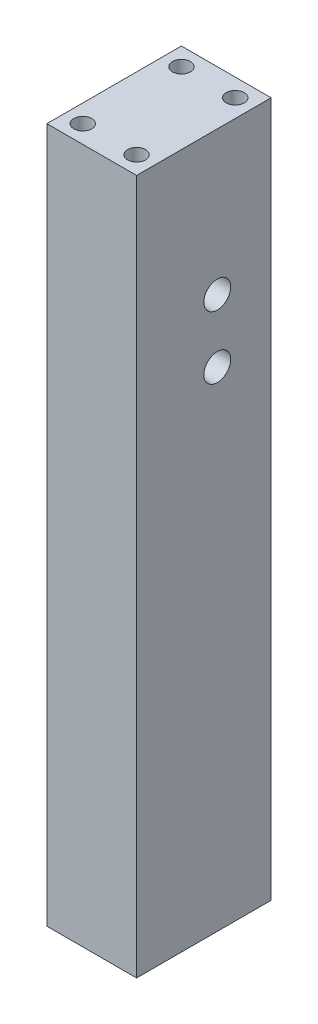
ISO-10303-21;
HEADER;
FILE_DESCRIPTION(('STEP AP214'),'2;1');
FILE_NAME('part.step','',(''),(''),'','','');
FILE_SCHEMA(('AUTOMOTIVE_DESIGN { 1 0 10303 214 1 1 1 1 }'));
ENDSEC;
DATA;
#1=APPLICATION_CONTEXT('core data for automotive mechanical design processes');
#2=APPLICATION_PROTOCOL_DEFINITION('international standard','automotive_design',2000,#1);
#3=PRODUCT_CONTEXT('',#1,'mechanical');
#4=PRODUCT('Part','Part','',(#3));
#5=PRODUCT_RELATED_PRODUCT_CATEGORY('part','',(#4));
#6=PRODUCT_DEFINITION_FORMATION('','',#4);
#7=PRODUCT_DEFINITION_CONTEXT('part definition',#1,'design');
#8=PRODUCT_DEFINITION('design','',#6,#7);
#9=PRODUCT_DEFINITION_SHAPE('','',#8);
#10=(LENGTH_UNIT() NAMED_UNIT(*) SI_UNIT(.MILLI.,.METRE.));
#11=(NAMED_UNIT(*) PLANE_ANGLE_UNIT() SI_UNIT($,.RADIAN.));
#12=(NAMED_UNIT(*) SI_UNIT($,.STERADIAN.) SOLID_ANGLE_UNIT());
#13=UNCERTAINTY_MEASURE_WITH_UNIT(LENGTH_MEASURE(1.E-05),#10,'distance_accuracy_value','');
#14=(GEOMETRIC_REPRESENTATION_CONTEXT(3) GLOBAL_UNCERTAINTY_ASSIGNED_CONTEXT((#13)) GLOBAL_UNIT_ASSIGNED_CONTEXT((#10,
#11,#12)) REPRESENTATION_CONTEXT('',''));
#15=CARTESIAN_POINT('',(0.,0.,0.));
#16=DIRECTION('',(0.,0.,1.));
#17=DIRECTION('',(1.,0.,0.));
#18=AXIS2_PLACEMENT_3D('',#15,#16,#17);
#19=CARTESIAN_POINT('',(10.,0.,0.));
#20=DIRECTION('',(-1.,0.,0.));
#21=DIRECTION('',(0.,0.,1.));
#22=AXIS2_PLACEMENT_3D('',#19,#20,#21);
#23=PLANE('',#22);
#24=DIRECTION('',(0.,-1.,0.));
#25=VECTOR('',#24,1.);
#26=CARTESIAN_POINT('',(10.,0.,0.));
#27=LINE('',#26,#25);
#28=CARTESIAN_POINT('',(10.,77.5,0.));
#29=VERTEX_POINT('',#28);
#30=CARTESIAN_POINT('',(10.,0.,0.));
#31=VERTEX_POINT('',#30);
#32=EDGE_CURVE('E84',#29,#31,#27,.T.);
#33=ORIENTED_EDGE('',*,*,#32,.T.);
#34=DIRECTION('',(0.,0.,-1.));
#35=VECTOR('',#34,1.);
#36=CARTESIAN_POINT('',(10.,0.,0.));
#37=LINE('',#36,#35);
#38=CARTESIAN_POINT('',(10.,0.,-15.));
#39=VERTEX_POINT('',#38);
#40=EDGE_CURVE('E79',#31,#39,#37,.T.);
#41=ORIENTED_EDGE('',*,*,#40,.T.);
#42=DIRECTION('',(0.,1.,0.));
#43=VECTOR('',#42,1.);
#44=CARTESIAN_POINT('',(10.,0.,-15.));
#45=LINE('',#44,#43);
#46=CARTESIAN_POINT('',(10.,77.5,-15.));
#47=VERTEX_POINT('',#46);
#48=EDGE_CURVE('E82',#39,#47,#45,.T.);
#49=ORIENTED_EDGE('',*,*,#48,.T.);
#50=DIRECTION('',(0.,0.,1.));
#51=VECTOR('',#50,1.);
#52=CARTESIAN_POINT('',(10.,77.5,0.));
#53=LINE('',#52,#51);
#54=EDGE_CURVE('E49',#47,#29,#53,.T.);
#55=ORIENTED_EDGE('',*,*,#54,.T.);
#56=EDGE_LOOP('',(#33,#41,#49,#55));
#57=FACE_BOUND('',#56,.T.);
#58=CARTESIAN_POINT('',(10.,54.5,-9.));
#59=DIRECTION('',(-1.,0.,0.));
#60=DIRECTION('',(0.,0.,1.));
#61=AXIS2_PLACEMENT_3D('',#58,#59,#60);
#62=CIRCLE('',#61,1.5);
#63=CARTESIAN_POINT('',(10.,54.5,-7.5));
#64=VERTEX_POINT('',#63);
#65=EDGE_CURVE('E163',#64,#64,#62,.T.);
#66=ORIENTED_EDGE('',*,*,#65,.T.);
#67=EDGE_LOOP('',(#66));
#68=FACE_BOUND('',#67,.T.);
#69=CARTESIAN_POINT('',(10.,61.5,-9.));
#70=DIRECTION('',(1.,0.,0.));
#71=DIRECTION('',(0.,0.,-1.));
#72=AXIS2_PLACEMENT_3D('',#69,#70,#71);
#73=CIRCLE('',#72,1.5);
#74=CARTESIAN_POINT('',(10.,61.5,-10.5));
#75=VERTEX_POINT('',#74);
#76=EDGE_CURVE('E166',#75,#75,#73,.T.);
#77=ORIENTED_EDGE('',*,*,#76,.F.);
#78=EDGE_LOOP('',(#77));
#79=FACE_BOUND('',#78,.T.);
#80=ADVANCED_FACE('F32',(#57,#68,#79),#23,.F.);
#81=CARTESIAN_POINT('',(10.,0.,0.));
#82=DIRECTION('',(0.,1.,0.));
#83=DIRECTION('',(0.,0.,1.));
#84=AXIS2_PLACEMENT_3D('',#81,#82,#83);
#85=PLANE('',#84);
#86=CARTESIAN_POINT('',(8.,0.,-13.));
#87=DIRECTION('',(0.,-1.,0.));
#88=DIRECTION('',(0.,0.,-1.));
#89=AXIS2_PLACEMENT_3D('',#86,#87,#88);
#90=CIRCLE('',#89,1.);
#91=CARTESIAN_POINT('',(8.,0.,-14.));
#92=VERTEX_POINT('',#91);
#93=EDGE_CURVE('E139',#92,#92,#90,.T.);
#94=ORIENTED_EDGE('',*,*,#93,.F.);
#95=EDGE_LOOP('',(#94));
#96=FACE_BOUND('',#95,.T.);
#97=CARTESIAN_POINT('',(8.,0.,-2.));
#98=DIRECTION('',(0.,-1.,0.));
#99=DIRECTION('',(0.,0.,-1.));
#100=AXIS2_PLACEMENT_3D('',#97,#98,#99);
#101=CIRCLE('',#100,1.);
#102=CARTESIAN_POINT('',(8.,0.,-3.));
#103=VERTEX_POINT('',#102);
#104=EDGE_CURVE('E136',#103,#103,#101,.F.);
#105=ORIENTED_EDGE('',*,*,#104,.T.);
#106=EDGE_LOOP('',(#105));
#107=FACE_BOUND('',#106,.T.);
#108=DIRECTION('',(0.,0.,-1.));
#109=VECTOR('',#108,1.);
#110=CARTESIAN_POINT('',(0.,0.,0.));
#111=LINE('',#110,#109);
#112=CARTESIAN_POINT('',(0.,0.,0.));
#113=VERTEX_POINT('',#112);
#114=CARTESIAN_POINT('',(0.,0.,-15.));
#115=VERTEX_POINT('',#114);
#116=EDGE_CURVE('E89',#113,#115,#111,.T.);
#117=ORIENTED_EDGE('',*,*,#116,.T.);
#118=DIRECTION('',(-1.,0.,0.));
#119=VECTOR('',#118,1.);
#120=CARTESIAN_POINT('',(10.,0.,-15.));
#121=LINE('',#120,#119);
#122=EDGE_CURVE('E41',#39,#115,#121,.T.);
#123=ORIENTED_EDGE('',*,*,#122,.F.);
#124=ORIENTED_EDGE('',*,*,#40,.F.);
#125=DIRECTION('',(-1.,0.,0.));
#126=VECTOR('',#125,1.);
#127=CARTESIAN_POINT('',(10.,0.,0.));
#128=LINE('',#127,#126);
#129=EDGE_CURVE('E11',#31,#113,#128,.T.);
#130=ORIENTED_EDGE('',*,*,#129,.T.);
#131=EDGE_LOOP('',(#117,#123,#124,#130));
#132=FACE_BOUND('',#131,.T.);
#133=CARTESIAN_POINT('',(2.,0.,-13.));
#134=DIRECTION('',(0.,-1.,0.));
#135=DIRECTION('',(0.,0.,-1.));
#136=AXIS2_PLACEMENT_3D('',#133,#134,#135);
#137=CIRCLE('',#136,1.);
#138=CARTESIAN_POINT('',(2.,0.,-14.));
#139=VERTEX_POINT('',#138);
#140=EDGE_CURVE('E152',#139,#139,#137,.F.);
#141=ORIENTED_EDGE('',*,*,#140,.T.);
#142=EDGE_LOOP('',(#141));
#143=FACE_BOUND('',#142,.T.);
#144=CARTESIAN_POINT('',(2.,0.,-2.));
#145=DIRECTION('',(0.,-1.,0.));
#146=DIRECTION('',(0.,0.,-1.));
#147=AXIS2_PLACEMENT_3D('',#144,#145,#146);
#148=CIRCLE('',#147,1.);
#149=CARTESIAN_POINT('',(2.,0.,-3.));
#150=VERTEX_POINT('',#149);
#151=EDGE_CURVE('E145',#150,#150,#148,.T.);
#152=ORIENTED_EDGE('',*,*,#151,.F.);
#153=EDGE_LOOP('',(#152));
#154=FACE_BOUND('',#153,.T.);
#155=ADVANCED_FACE('F87',(#96,#107,#132,#143,#154),#85,.F.);
#156=CARTESIAN_POINT('',(10.,77.5,0.));
#157=DIRECTION('',(0.,-1.,0.));
#158=DIRECTION('',(0.,0.,-1.));
#159=AXIS2_PLACEMENT_3D('',#156,#157,#158);
#160=PLANE('',#159);
#161=CARTESIAN_POINT('',(8.,77.5,-2.));
#162=DIRECTION('',(0.,1.,0.));
#163=DIRECTION('',(0.,0.,1.));
#164=AXIS2_PLACEMENT_3D('',#161,#162,#163);
#165=CIRCLE('',#164,1.);
#166=CARTESIAN_POINT('',(8.,77.5,-1.));
#167=VERTEX_POINT('',#166);
#168=EDGE_CURVE('E125',#167,#167,#165,.T.);
#169=ORIENTED_EDGE('',*,*,#168,.F.);
#170=EDGE_LOOP('',(#169));
#171=FACE_BOUND('',#170,.T.);
#172=CARTESIAN_POINT('',(2.,77.5,-13.));
#173=DIRECTION('',(0.,1.,0.));
#174=DIRECTION('',(0.,0.,1.));
#175=AXIS2_PLACEMENT_3D('',#172,#173,#174);
#176=CIRCLE('',#175,1.);
#177=CARTESIAN_POINT('',(2.,77.5,-12.));
#178=VERTEX_POINT('',#177);
#179=EDGE_CURVE('E112',#178,#178,#176,.T.);
#180=ORIENTED_EDGE('',*,*,#179,.F.);
#181=EDGE_LOOP('',(#180));
#182=FACE_BOUND('',#181,.T.);
#183=DIRECTION('',(0.,0.,1.));
#184=VECTOR('',#183,1.);
#185=CARTESIAN_POINT('',(0.,77.5,0.));
#186=LINE('',#185,#184);
#187=CARTESIAN_POINT('',(0.,77.5,-15.));
#188=VERTEX_POINT('',#187);
#189=CARTESIAN_POINT('',(0.,77.5,0.));
#190=VERTEX_POINT('',#189);
#191=EDGE_CURVE('E72',#188,#190,#186,.T.);
#192=ORIENTED_EDGE('',*,*,#191,.T.);
#193=DIRECTION('',(-1.,0.,0.));
#194=VECTOR('',#193,1.);
#195=CARTESIAN_POINT('',(10.,77.5,0.));
#196=LINE('',#195,#194);
#197=EDGE_CURVE('E93',#29,#190,#196,.T.);
#198=ORIENTED_EDGE('',*,*,#197,.F.);
#199=ORIENTED_EDGE('',*,*,#54,.F.);
#200=DIRECTION('',(-1.,0.,0.));
#201=VECTOR('',#200,1.);
#202=CARTESIAN_POINT('',(10.,77.5,-15.));
#203=LINE('',#202,#201);
#204=EDGE_CURVE('E90',#47,#188,#203,.T.);
#205=ORIENTED_EDGE('',*,*,#204,.T.);
#206=EDGE_LOOP('',(#192,#198,#199,#205));
#207=FACE_BOUND('',#206,.T.);
#208=CARTESIAN_POINT('',(8.,77.5,-13.));
#209=DIRECTION('',(0.,1.,0.));
#210=DIRECTION('',(0.,0.,1.));
#211=AXIS2_PLACEMENT_3D('',#208,#209,#210);
#212=CIRCLE('',#211,1.);
#213=CARTESIAN_POINT('',(8.,77.5,-12.));
#214=VERTEX_POINT('',#213);
#215=EDGE_CURVE('E131',#214,#214,#212,.F.);
#216=ORIENTED_EDGE('',*,*,#215,.T.);
#217=EDGE_LOOP('',(#216));
#218=FACE_BOUND('',#217,.T.);
#219=CARTESIAN_POINT('',(2.,77.5,-2.));
#220=DIRECTION('',(0.,1.,0.));
#221=DIRECTION('',(0.,0.,1.));
#222=AXIS2_PLACEMENT_3D('',#219,#220,#221);
#223=CIRCLE('',#222,1.);
#224=CARTESIAN_POINT('',(2.,77.5,-1.));
#225=VERTEX_POINT('',#224);
#226=EDGE_CURVE('E118',#225,#225,#223,.F.);
#227=ORIENTED_EDGE('',*,*,#226,.T.);
#228=EDGE_LOOP('',(#227));
#229=FACE_BOUND('',#228,.T.);
#230=ADVANCED_FACE('F105',(#171,#182,#207,#218,#229),#160,.F.);
#231=CARTESIAN_POINT('',(10.,0.,0.));
#232=DIRECTION('',(0.,0.,-1.));
#233=DIRECTION('',(-1.,0.,0.));
#234=AXIS2_PLACEMENT_3D('',#231,#232,#233);
#235=PLANE('',#234);
#236=DIRECTION('',(0.,-1.,0.));
#237=VECTOR('',#236,1.);
#238=CARTESIAN_POINT('',(0.,0.,0.));
#239=LINE('',#238,#237);
#240=EDGE_CURVE('E97',#190,#113,#239,.T.);
#241=ORIENTED_EDGE('',*,*,#240,.T.);
#242=ORIENTED_EDGE('',*,*,#129,.F.);
#243=ORIENTED_EDGE('',*,*,#32,.F.);
#244=ORIENTED_EDGE('',*,*,#197,.T.);
#245=EDGE_LOOP('',(#241,#242,#243,#244));
#246=FACE_BOUND('',#245,.T.);
#247=ADVANCED_FACE('F34',(#246),#235,.F.);
#248=CARTESIAN_POINT('',(10.,0.,-15.));
#249=DIRECTION('',(0.,0.,1.));
#250=DIRECTION('',(0.,-1.,0.));
#251=AXIS2_PLACEMENT_3D('',#248,#249,#250);
#252=PLANE('',#251);
#253=DIRECTION('',(0.,1.,0.));
#254=VECTOR('',#253,1.);
#255=CARTESIAN_POINT('',(0.,0.,-15.));
#256=LINE('',#255,#254);
#257=EDGE_CURVE('E66',#115,#188,#256,.T.);
#258=ORIENTED_EDGE('',*,*,#257,.T.);
#259=ORIENTED_EDGE('',*,*,#204,.F.);
#260=ORIENTED_EDGE('',*,*,#48,.F.);
#261=ORIENTED_EDGE('',*,*,#122,.T.);
#262=EDGE_LOOP('',(#258,#259,#260,#261));
#263=FACE_BOUND('',#262,.T.);
#264=ADVANCED_FACE('F91',(#263),#252,.F.);
#265=CARTESIAN_POINT('',(0.,0.,0.));
#266=DIRECTION('',(-1.,0.,0.));
#267=DIRECTION('',(0.,0.,1.));
#268=AXIS2_PLACEMENT_3D('',#265,#266,#267);
#269=PLANE('',#268);
#270=ORIENTED_EDGE('',*,*,#240,.F.);
#271=ORIENTED_EDGE('',*,*,#191,.F.);
#272=ORIENTED_EDGE('',*,*,#257,.F.);
#273=ORIENTED_EDGE('',*,*,#116,.F.);
#274=EDGE_LOOP('',(#270,#271,#272,#273));
#275=FACE_BOUND('',#274,.T.);
#276=ADVANCED_FACE('F109',(#275),#269,.T.);
#277=CARTESIAN_POINT('',(2.,67.5,-13.));
#278=DIRECTION('',(0.,1.,0.));
#279=DIRECTION('',(0.,0.,1.));
#280=AXIS2_PLACEMENT_3D('',#277,#278,#279);
#281=CYLINDRICAL_SURFACE('',#280,1.);
#282=CARTESIAN_POINT('',(2.,67.5,-13.));
#283=DIRECTION('',(0.,1.,0.));
#284=DIRECTION('',(0.,0.,1.));
#285=AXIS2_PLACEMENT_3D('',#282,#283,#284);
#286=CIRCLE('',#285,1.);
#287=CARTESIAN_POINT('',(2.,67.5,-12.));
#288=VERTEX_POINT('',#287);
#289=EDGE_CURVE('E100',#288,#288,#286,.T.);
#290=ORIENTED_EDGE('',*,*,#289,.F.);
#291=EDGE_LOOP('',(#290));
#292=FACE_BOUND('',#291,.T.);
#293=ORIENTED_EDGE('',*,*,#179,.T.);
#294=EDGE_LOOP('',(#293));
#295=FACE_BOUND('',#294,.T.);
#296=ADVANCED_FACE('F189',(#292,#295),#281,.F.);
#297=CARTESIAN_POINT('',(0.,67.5,0.));
#298=DIRECTION('',(0.,1.,0.));
#299=DIRECTION('',(0.,0.,1.));
#300=AXIS2_PLACEMENT_3D('',#297,#298,#299);
#301=PLANE('',#300);
#302=ORIENTED_EDGE('',*,*,#289,.T.);
#303=EDGE_LOOP('',(#302));
#304=FACE_BOUND('',#303,.T.);
#305=ADVANCED_FACE('F348',(#304),#301,.T.);
#306=CARTESIAN_POINT('',(8.,67.5,-13.));
#307=DIRECTION('',(0.,1.,0.));
#308=DIRECTION('',(0.,0.,1.));
#309=AXIS2_PLACEMENT_3D('',#306,#307,#308);
#310=CYLINDRICAL_SURFACE('',#309,1.);
#311=CARTESIAN_POINT('',(8.,67.5,-13.));
#312=DIRECTION('',(0.,1.,0.));
#313=DIRECTION('',(0.,0.,1.));
#314=AXIS2_PLACEMENT_3D('',#311,#312,#313);
#315=CIRCLE('',#314,1.);
#316=CARTESIAN_POINT('',(8.,67.5,-12.));
#317=VERTEX_POINT('',#316);
#318=EDGE_CURVE('E115',#317,#317,#315,.F.);
#319=ORIENTED_EDGE('',*,*,#318,.T.);
#320=EDGE_LOOP('',(#319));
#321=FACE_BOUND('',#320,.T.);
#322=ORIENTED_EDGE('',*,*,#215,.F.);
#323=EDGE_LOOP('',(#322));
#324=FACE_BOUND('',#323,.T.);
#325=ADVANCED_FACE('F344',(#321,#324),#310,.F.);
#326=CARTESIAN_POINT('',(0.,67.5,0.));
#327=DIRECTION('',(0.,1.,0.));
#328=DIRECTION('',(0.,0.,1.));
#329=AXIS2_PLACEMENT_3D('',#326,#327,#328);
#330=PLANE('',#329);
#331=ORIENTED_EDGE('',*,*,#318,.F.);
#332=EDGE_LOOP('',(#331));
#333=FACE_BOUND('',#332,.T.);
#334=ADVANCED_FACE('F340',(#333),#330,.T.);
#335=CARTESIAN_POINT('',(8.,67.5,-2.));
#336=DIRECTION('',(0.,1.,0.));
#337=DIRECTION('',(0.,0.,1.));
#338=AXIS2_PLACEMENT_3D('',#335,#336,#337);
#339=CYLINDRICAL_SURFACE('',#338,1.);
#340=CARTESIAN_POINT('',(8.,67.5,-2.));
#341=DIRECTION('',(0.,1.,0.));
#342=DIRECTION('',(0.,0.,1.));
#343=AXIS2_PLACEMENT_3D('',#340,#341,#342);
#344=CIRCLE('',#343,1.);
#345=CARTESIAN_POINT('',(8.,67.5,-1.));
#346=VERTEX_POINT('',#345);
#347=EDGE_CURVE('E128',#346,#346,#344,.T.);
#348=ORIENTED_EDGE('',*,*,#347,.F.);
#349=EDGE_LOOP('',(#348));
#350=FACE_BOUND('',#349,.T.);
#351=ORIENTED_EDGE('',*,*,#168,.T.);
#352=EDGE_LOOP('',(#351));
#353=FACE_BOUND('',#352,.T.);
#354=ADVANCED_FACE('F343',(#350,#353),#339,.F.);
#355=CARTESIAN_POINT('',(0.,67.5,0.));
#356=DIRECTION('',(0.,1.,0.));
#357=DIRECTION('',(0.,0.,1.));
#358=AXIS2_PLACEMENT_3D('',#355,#356,#357);
#359=PLANE('',#358);
#360=ORIENTED_EDGE('',*,*,#347,.T.);
#361=EDGE_LOOP('',(#360));
#362=FACE_BOUND('',#361,.T.);
#363=ADVANCED_FACE('F350',(#362),#359,.T.);
#364=CARTESIAN_POINT('',(2.,67.5,-2.));
#365=DIRECTION('',(0.,1.,0.));
#366=DIRECTION('',(0.,0.,1.));
#367=AXIS2_PLACEMENT_3D('',#364,#365,#366);
#368=CYLINDRICAL_SURFACE('',#367,1.);
#369=CARTESIAN_POINT('',(2.,67.5,-2.));
#370=DIRECTION('',(0.,1.,0.));
#371=DIRECTION('',(0.,0.,1.));
#372=AXIS2_PLACEMENT_3D('',#369,#370,#371);
#373=CIRCLE('',#372,1.);
#374=CARTESIAN_POINT('',(2.,67.5,-1.));
#375=VERTEX_POINT('',#374);
#376=EDGE_CURVE('E121',#375,#375,#373,.F.);
#377=ORIENTED_EDGE('',*,*,#376,.T.);
#378=EDGE_LOOP('',(#377));
#379=FACE_BOUND('',#378,.T.);
#380=ORIENTED_EDGE('',*,*,#226,.F.);
#381=EDGE_LOOP('',(#380));
#382=FACE_BOUND('',#381,.T.);
#383=ADVANCED_FACE('F353',(#379,#382),#368,.F.);
#384=CARTESIAN_POINT('',(0.,67.5,0.));
#385=DIRECTION('',(0.,1.,0.));
#386=DIRECTION('',(0.,0.,1.));
#387=AXIS2_PLACEMENT_3D('',#384,#385,#386);
#388=PLANE('',#387);
#389=ORIENTED_EDGE('',*,*,#376,.F.);
#390=EDGE_LOOP('',(#389));
#391=FACE_BOUND('',#390,.T.);
#392=ADVANCED_FACE('F220',(#391),#388,.T.);
#393=CARTESIAN_POINT('',(8.,10.,-2.));
#394=DIRECTION('',(0.,-1.,0.));
#395=DIRECTION('',(0.,0.,-1.));
#396=AXIS2_PLACEMENT_3D('',#393,#394,#395);
#397=CYLINDRICAL_SURFACE('',#396,1.);
#398=CARTESIAN_POINT('',(8.,10.,-2.));
#399=DIRECTION('',(0.,-1.,0.));
#400=DIRECTION('',(0.,0.,-1.));
#401=AXIS2_PLACEMENT_3D('',#398,#399,#400);
#402=CIRCLE('',#401,1.);
#403=CARTESIAN_POINT('',(8.,10.,-3.));
#404=VERTEX_POINT('',#403);
#405=EDGE_CURVE('E122',#404,#404,#402,.F.);
#406=ORIENTED_EDGE('',*,*,#405,.T.);
#407=EDGE_LOOP('',(#406));
#408=FACE_BOUND('',#407,.T.);
#409=ORIENTED_EDGE('',*,*,#104,.F.);
#410=EDGE_LOOP('',(#409));
#411=FACE_BOUND('',#410,.T.);
#412=ADVANCED_FACE('F224',(#408,#411),#397,.F.);
#413=CARTESIAN_POINT('',(0.,10.,0.));
#414=DIRECTION('',(0.,-1.,0.));
#415=DIRECTION('',(0.,0.,-1.));
#416=AXIS2_PLACEMENT_3D('',#413,#414,#415);
#417=PLANE('',#416);
#418=ORIENTED_EDGE('',*,*,#405,.F.);
#419=EDGE_LOOP('',(#418));
#420=FACE_BOUND('',#419,.T.);
#421=ADVANCED_FACE('F228',(#420),#417,.T.);
#422=CARTESIAN_POINT('',(8.,10.,-13.));
#423=DIRECTION('',(0.,-1.,0.));
#424=DIRECTION('',(0.,0.,-1.));
#425=AXIS2_PLACEMENT_3D('',#422,#423,#424);
#426=CYLINDRICAL_SURFACE('',#425,1.);
#427=CARTESIAN_POINT('',(8.,10.,-13.));
#428=DIRECTION('',(0.,-1.,0.));
#429=DIRECTION('',(0.,0.,-1.));
#430=AXIS2_PLACEMENT_3D('',#427,#428,#429);
#431=CIRCLE('',#430,1.);
#432=CARTESIAN_POINT('',(8.,10.,-14.));
#433=VERTEX_POINT('',#432);
#434=EDGE_CURVE('E155',#433,#433,#431,.T.);
#435=ORIENTED_EDGE('',*,*,#434,.F.);
#436=EDGE_LOOP('',(#435));
#437=FACE_BOUND('',#436,.T.);
#438=ORIENTED_EDGE('',*,*,#93,.T.);
#439=EDGE_LOOP('',(#438));
#440=FACE_BOUND('',#439,.T.);
#441=ADVANCED_FACE('F238',(#437,#440),#426,.F.);
#442=CARTESIAN_POINT('',(0.,10.,0.));
#443=DIRECTION('',(0.,-1.,0.));
#444=DIRECTION('',(0.,0.,-1.));
#445=AXIS2_PLACEMENT_3D('',#442,#443,#444);
#446=PLANE('',#445);
#447=ORIENTED_EDGE('',*,*,#434,.T.);
#448=EDGE_LOOP('',(#447));
#449=FACE_BOUND('',#448,.T.);
#450=ADVANCED_FACE('F248',(#449),#446,.T.);
#451=CARTESIAN_POINT('',(2.,10.,-13.));
#452=DIRECTION('',(0.,-1.,0.));
#453=DIRECTION('',(0.,0.,-1.));
#454=AXIS2_PLACEMENT_3D('',#451,#452,#453);
#455=CYLINDRICAL_SURFACE('',#454,1.);
#456=CARTESIAN_POINT('',(2.,10.,-13.));
#457=DIRECTION('',(0.,-1.,0.));
#458=DIRECTION('',(0.,0.,-1.));
#459=AXIS2_PLACEMENT_3D('',#456,#457,#458);
#460=CIRCLE('',#459,1.);
#461=CARTESIAN_POINT('',(2.,10.,-14.));
#462=VERTEX_POINT('',#461);
#463=EDGE_CURVE('E149',#462,#462,#460,.F.);
#464=ORIENTED_EDGE('',*,*,#463,.T.);
#465=EDGE_LOOP('',(#464));
#466=FACE_BOUND('',#465,.T.);
#467=ORIENTED_EDGE('',*,*,#140,.F.);
#468=EDGE_LOOP('',(#467));
#469=FACE_BOUND('',#468,.T.);
#470=ADVANCED_FACE('F258',(#466,#469),#455,.F.);
#471=CARTESIAN_POINT('',(0.,10.,0.));
#472=DIRECTION('',(0.,-1.,0.));
#473=DIRECTION('',(0.,0.,-1.));
#474=AXIS2_PLACEMENT_3D('',#471,#472,#473);
#475=PLANE('',#474);
#476=ORIENTED_EDGE('',*,*,#463,.F.);
#477=EDGE_LOOP('',(#476));
#478=FACE_BOUND('',#477,.T.);
#479=ADVANCED_FACE('F268',(#478),#475,.T.);
#480=CARTESIAN_POINT('',(2.,10.,-2.));
#481=DIRECTION('',(0.,-1.,0.));
#482=DIRECTION('',(0.,0.,-1.));
#483=AXIS2_PLACEMENT_3D('',#480,#481,#482);
#484=CYLINDRICAL_SURFACE('',#483,1.);
#485=CARTESIAN_POINT('',(2.,10.,-2.));
#486=DIRECTION('',(0.,-1.,0.));
#487=DIRECTION('',(0.,0.,-1.));
#488=AXIS2_PLACEMENT_3D('',#485,#486,#487);
#489=CIRCLE('',#488,1.);
#490=CARTESIAN_POINT('',(2.,10.,-3.));
#491=VERTEX_POINT('',#490);
#492=EDGE_CURVE('E142',#491,#491,#489,.T.);
#493=ORIENTED_EDGE('',*,*,#492,.F.);
#494=EDGE_LOOP('',(#493));
#495=FACE_BOUND('',#494,.T.);
#496=ORIENTED_EDGE('',*,*,#151,.T.);
#497=EDGE_LOOP('',(#496));
#498=FACE_BOUND('',#497,.T.);
#499=ADVANCED_FACE('F278',(#495,#498),#484,.F.);
#500=CARTESIAN_POINT('',(2.,10.,-2.));
#501=DIRECTION('',(0.,-1.,0.));
#502=DIRECTION('',(0.,0.,-1.));
#503=AXIS2_PLACEMENT_3D('',#500,#501,#502);
#504=PLANE('',#503);
#505=ORIENTED_EDGE('',*,*,#492,.T.);
#506=EDGE_LOOP('',(#505));
#507=FACE_BOUND('',#506,.T.);
#508=ADVANCED_FACE('F288',(#507),#504,.T.);
#509=CARTESIAN_POINT('',(5.,54.5,-9.));
#510=DIRECTION('',(1.,0.,0.));
#511=DIRECTION('',(0.,0.,-1.));
#512=AXIS2_PLACEMENT_3D('',#509,#510,#511);
#513=CYLINDRICAL_SURFACE('',#512,1.5);
#514=CARTESIAN_POINT('',(5.,54.5,-9.));
#515=DIRECTION('',(-1.,0.,0.));
#516=DIRECTION('',(0.,0.,1.));
#517=AXIS2_PLACEMENT_3D('',#514,#515,#516);
#518=CIRCLE('',#517,1.5);
#519=CARTESIAN_POINT('',(5.,54.5,-7.5));
#520=VERTEX_POINT('',#519);
#521=EDGE_CURVE('E160',#520,#520,#518,.T.);
#522=ORIENTED_EDGE('',*,*,#521,.T.);
#523=EDGE_LOOP('',(#522));
#524=FACE_BOUND('',#523,.T.);
#525=ORIENTED_EDGE('',*,*,#65,.F.);
#526=EDGE_LOOP('',(#525));
#527=FACE_BOUND('',#526,.T.);
#528=ADVANCED_FACE('F297',(#524,#527),#513,.F.);
#529=CARTESIAN_POINT('',(5.,54.5,-9.));
#530=DIRECTION('',(-1.,0.,0.));
#531=DIRECTION('',(0.,0.,1.));
#532=AXIS2_PLACEMENT_3D('',#529,#530,#531);
#533=PLANE('',#532);
#534=ORIENTED_EDGE('',*,*,#521,.F.);
#535=EDGE_LOOP('',(#534));
#536=FACE_BOUND('',#535,.T.);
#537=ADVANCED_FACE('F177',(#536),#533,.F.);
#538=CARTESIAN_POINT('',(5.,61.5,-9.));
#539=DIRECTION('',(1.,0.,0.));
#540=DIRECTION('',(0.,0.,-1.));
#541=AXIS2_PLACEMENT_3D('',#538,#539,#540);
#542=CYLINDRICAL_SURFACE('',#541,1.5);
#543=CARTESIAN_POINT('',(5.,61.5,-9.));
#544=DIRECTION('',(1.,0.,0.));
#545=DIRECTION('',(0.,0.,-1.));
#546=AXIS2_PLACEMENT_3D('',#543,#544,#545);
#547=CIRCLE('',#546,1.5);
#548=CARTESIAN_POINT('',(5.,61.5,-10.5));
#549=VERTEX_POINT('',#548);
#550=EDGE_CURVE('E146',#549,#549,#547,.T.);
#551=ORIENTED_EDGE('',*,*,#550,.F.);
#552=EDGE_LOOP('',(#551));
#553=FACE_BOUND('',#552,.T.);
#554=ORIENTED_EDGE('',*,*,#76,.T.);
#555=EDGE_LOOP('',(#554));
#556=FACE_BOUND('',#555,.T.);
#557=ADVANCED_FACE('F174',(#553,#556),#542,.F.);
#558=CARTESIAN_POINT('',(5.,61.5,-9.));
#559=DIRECTION('',(1.,0.,0.));
#560=DIRECTION('',(0.,0.,-1.));
#561=AXIS2_PLACEMENT_3D('',#558,#559,#560);
#562=PLANE('',#561);
#563=ORIENTED_EDGE('',*,*,#550,.T.);
#564=EDGE_LOOP('',(#563));
#565=FACE_BOUND('',#564,.T.);
#566=ADVANCED_FACE('F172',(#565),#562,.T.);
#567=CLOSED_SHELL('',(#80,#155,#230,#247,#264,#276,#296,#305,#325,#334,#354,#363,#383,#392,#412,
#421,#441,#450,#470,#479,#499,#508,#528,#537,#557,#566));
#568=MANIFOLD_SOLID_BREP('B2',#567);
#569=ADVANCED_BREP_SHAPE_REPRESENTATION('',(#18,#568),#14);
#570=SHAPE_DEFINITION_REPRESENTATION(#9,#569);
ENDSEC;
END-ISO-10303-21;
